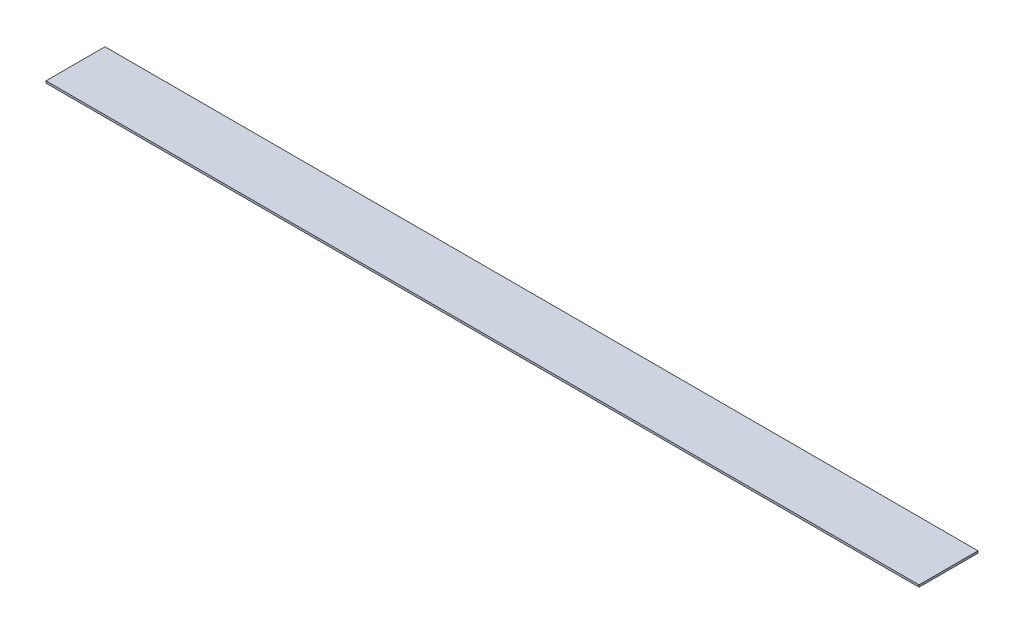
ISO-10303-21;
HEADER;
FILE_DESCRIPTION(('STEP AP214'),'2;1');
FILE_NAME('part.step','',(''),(''),'','','');
FILE_SCHEMA(('AUTOMOTIVE_DESIGN { 1 0 10303 214 1 1 1 1 }'));
ENDSEC;
DATA;
#1=APPLICATION_CONTEXT('core data for automotive mechanical design processes');
#2=APPLICATION_PROTOCOL_DEFINITION('international standard','automotive_design',2000,#1);
#3=PRODUCT_CONTEXT('',#1,'mechanical');
#4=PRODUCT('Part','Part','',(#3));
#5=PRODUCT_RELATED_PRODUCT_CATEGORY('part','',(#4));
#6=PRODUCT_DEFINITION_FORMATION('','',#4);
#7=PRODUCT_DEFINITION_CONTEXT('part definition',#1,'design');
#8=PRODUCT_DEFINITION('design','',#6,#7);
#9=PRODUCT_DEFINITION_SHAPE('','',#8);
#10=(LENGTH_UNIT() NAMED_UNIT(*) SI_UNIT(.MILLI.,.METRE.));
#11=(NAMED_UNIT(*) PLANE_ANGLE_UNIT() SI_UNIT($,.RADIAN.));
#12=(NAMED_UNIT(*) SI_UNIT($,.STERADIAN.) SOLID_ANGLE_UNIT());
#13=UNCERTAINTY_MEASURE_WITH_UNIT(LENGTH_MEASURE(1.E-05),#10,'distance_accuracy_value','');
#14=(GEOMETRIC_REPRESENTATION_CONTEXT(3) GLOBAL_UNCERTAINTY_ASSIGNED_CONTEXT((#13)) GLOBAL_UNIT_ASSIGNED_CONTEXT((#10,
#11,#12)) REPRESENTATION_CONTEXT('',''));
#15=CARTESIAN_POINT('',(0.,0.,0.));
#16=DIRECTION('',(0.,0.,1.));
#17=DIRECTION('',(1.,0.,0.));
#18=AXIS2_PLACEMENT_3D('',#15,#16,#17);
#19=CARTESIAN_POINT('',(0.,0.9,-12.8));
#20=DIRECTION('',(0.,0.,-1.));
#21=DIRECTION('',(-1.,0.,0.));
#22=AXIS2_PLACEMENT_3D('',#19,#20,#21);
#23=PLANE('',#22);
#24=DIRECTION('',(1.,0.,0.));
#25=VECTOR('',#24,1.);
#26=CARTESIAN_POINT('',(0.,0.9,-12.8));
#27=LINE('',#26,#25);
#28=CARTESIAN_POINT('',(-240.,0.9,-12.8));
#29=VERTEX_POINT('',#28);
#30=CARTESIAN_POINT('',(139.,0.9,-12.8));
#31=VERTEX_POINT('',#30);
#32=EDGE_CURVE('E84',#29,#31,#27,.T.);
#33=ORIENTED_EDGE('',*,*,#32,.T.);
#34=DIRECTION('',(0.,1.,0.));
#35=VECTOR('',#34,1.);
#36=CARTESIAN_POINT('',(139.,0.9,-12.8));
#37=LINE('',#36,#35);
#38=CARTESIAN_POINT('',(139.,0.,-12.8));
#39=VERTEX_POINT('',#38);
#40=EDGE_CURVE('E99',#39,#31,#37,.T.);
#41=ORIENTED_EDGE('',*,*,#40,.F.);
#42=DIRECTION('',(1.,0.,0.));
#43=VECTOR('',#42,1.);
#44=CARTESIAN_POINT('',(0.,0.,-12.8));
#45=LINE('',#44,#43);
#46=CARTESIAN_POINT('',(-240.,0.,-12.8));
#47=VERTEX_POINT('',#46);
#48=EDGE_CURVE('E88',#47,#39,#45,.T.);
#49=ORIENTED_EDGE('',*,*,#48,.F.);
#50=DIRECTION('',(0.,-1.,0.));
#51=VECTOR('',#50,1.);
#52=CARTESIAN_POINT('',(-240.,0.9,-12.8));
#53=LINE('',#52,#51);
#54=EDGE_CURVE('E11',#29,#47,#53,.T.);
#55=ORIENTED_EDGE('',*,*,#54,.F.);
#56=EDGE_LOOP('',(#33,#41,#49,#55));
#57=FACE_BOUND('',#56,.T.);
#58=ADVANCED_FACE('F39',(#57),#23,.T.);
#59=CARTESIAN_POINT('',(0.,0.9,12.8));
#60=DIRECTION('',(0.,0.,-1.));
#61=DIRECTION('',(-1.,0.,0.));
#62=AXIS2_PLACEMENT_3D('',#59,#60,#61);
#63=PLANE('',#62);
#64=DIRECTION('',(0.,-1.,0.));
#65=VECTOR('',#64,1.);
#66=CARTESIAN_POINT('',(139.,0.9,12.8));
#67=LINE('',#66,#65);
#68=CARTESIAN_POINT('',(139.,0.9,12.8));
#69=VERTEX_POINT('',#68);
#70=CARTESIAN_POINT('',(139.,0.,12.8));
#71=VERTEX_POINT('',#70);
#72=EDGE_CURVE('E53',#69,#71,#67,.T.);
#73=ORIENTED_EDGE('',*,*,#72,.F.);
#74=DIRECTION('',(1.,0.,0.));
#75=VECTOR('',#74,1.);
#76=CARTESIAN_POINT('',(0.,0.9,12.8));
#77=LINE('',#76,#75);
#78=CARTESIAN_POINT('',(-240.,0.9,12.8));
#79=VERTEX_POINT('',#78);
#80=EDGE_CURVE('E76',#79,#69,#77,.T.);
#81=ORIENTED_EDGE('',*,*,#80,.F.);
#82=DIRECTION('',(0.,-1.,0.));
#83=VECTOR('',#82,1.);
#84=CARTESIAN_POINT('',(-240.,0.9,12.8));
#85=LINE('',#84,#83);
#86=CARTESIAN_POINT('',(-240.,0.,12.8));
#87=VERTEX_POINT('',#86);
#88=EDGE_CURVE('E46',#79,#87,#85,.T.);
#89=ORIENTED_EDGE('',*,*,#88,.T.);
#90=DIRECTION('',(1.,0.,0.));
#91=VECTOR('',#90,1.);
#92=CARTESIAN_POINT('',(0.,0.,12.8));
#93=LINE('',#92,#91);
#94=EDGE_CURVE('E74',#87,#71,#93,.T.);
#95=ORIENTED_EDGE('',*,*,#94,.T.);
#96=EDGE_LOOP('',(#73,#81,#89,#95));
#97=FACE_BOUND('',#96,.T.);
#98=ADVANCED_FACE('F73',(#97),#63,.F.);
#99=CARTESIAN_POINT('',(0.,0.9,0.));
#100=DIRECTION('',(0.,1.,0.));
#101=DIRECTION('',(0.,0.,1.));
#102=AXIS2_PLACEMENT_3D('',#99,#100,#101);
#103=PLANE('',#102);
#104=ORIENTED_EDGE('',*,*,#80,.T.);
#105=DIRECTION('',(0.,0.,1.));
#106=VECTOR('',#105,1.);
#107=CARTESIAN_POINT('',(139.,0.9,12.8));
#108=LINE('',#107,#106);
#109=EDGE_CURVE('E90',#31,#69,#108,.T.);
#110=ORIENTED_EDGE('',*,*,#109,.F.);
#111=ORIENTED_EDGE('',*,*,#32,.F.);
#112=DIRECTION('',(0.,0.,-1.));
#113=VECTOR('',#112,1.);
#114=CARTESIAN_POINT('',(-240.,0.9,0.));
#115=LINE('',#114,#113);
#116=EDGE_CURVE('E94',#79,#29,#115,.T.);
#117=ORIENTED_EDGE('',*,*,#116,.F.);
#118=EDGE_LOOP('',(#104,#110,#111,#117));
#119=FACE_BOUND('',#118,.T.);
#120=ADVANCED_FACE('F113',(#119),#103,.T.);
#121=CARTESIAN_POINT('',(0.,0.,0.));
#122=DIRECTION('',(0.,1.,0.));
#123=DIRECTION('',(0.,0.,1.));
#124=AXIS2_PLACEMENT_3D('',#121,#122,#123);
#125=PLANE('',#124);
#126=DIRECTION('',(0.,0.,-1.));
#127=VECTOR('',#126,1.);
#128=CARTESIAN_POINT('',(139.,0.,12.8));
#129=LINE('',#128,#127);
#130=EDGE_CURVE('E83',#71,#39,#129,.T.);
#131=ORIENTED_EDGE('',*,*,#130,.F.);
#132=ORIENTED_EDGE('',*,*,#94,.F.);
#133=DIRECTION('',(0.,0.,-1.));
#134=VECTOR('',#133,1.);
#135=CARTESIAN_POINT('',(-240.,0.,0.));
#136=LINE('',#135,#134);
#137=EDGE_CURVE('E82',#87,#47,#136,.T.);
#138=ORIENTED_EDGE('',*,*,#137,.T.);
#139=ORIENTED_EDGE('',*,*,#48,.T.);
#140=EDGE_LOOP('',(#131,#132,#138,#139));
#141=FACE_BOUND('',#140,.T.);
#142=ADVANCED_FACE('F80',(#141),#125,.F.);
#143=CARTESIAN_POINT('',(-240.,0.9,0.));
#144=DIRECTION('',(-1.,0.,0.));
#145=DIRECTION('',(0.,0.,1.));
#146=AXIS2_PLACEMENT_3D('',#143,#144,#145);
#147=PLANE('',#146);
#148=ORIENTED_EDGE('',*,*,#137,.F.);
#149=ORIENTED_EDGE('',*,*,#88,.F.);
#150=ORIENTED_EDGE('',*,*,#116,.T.);
#151=ORIENTED_EDGE('',*,*,#54,.T.);
#152=EDGE_LOOP('',(#148,#149,#150,#151));
#153=FACE_BOUND('',#152,.T.);
#154=ADVANCED_FACE('F86',(#153),#147,.T.);
#155=CARTESIAN_POINT('',(139.,0.,0.));
#156=DIRECTION('',(1.,0.,0.));
#157=DIRECTION('',(0.,0.,-1.));
#158=AXIS2_PLACEMENT_3D('',#155,#156,#157);
#159=PLANE('',#158);
#160=ORIENTED_EDGE('',*,*,#72,.T.);
#161=ORIENTED_EDGE('',*,*,#130,.T.);
#162=ORIENTED_EDGE('',*,*,#40,.T.);
#163=ORIENTED_EDGE('',*,*,#109,.T.);
#164=EDGE_LOOP('',(#160,#161,#162,#163));
#165=FACE_BOUND('',#164,.T.);
#166=ADVANCED_FACE('F105',(#165),#159,.T.);
#167=CLOSED_SHELL('',(#58,#98,#120,#142,#154,#166));
#168=MANIFOLD_SOLID_BREP('B2',#167);
#169=ADVANCED_BREP_SHAPE_REPRESENTATION('',(#18,#168),#14);
#170=SHAPE_DEFINITION_REPRESENTATION(#9,#169);
ENDSEC;
END-ISO-10303-21;
